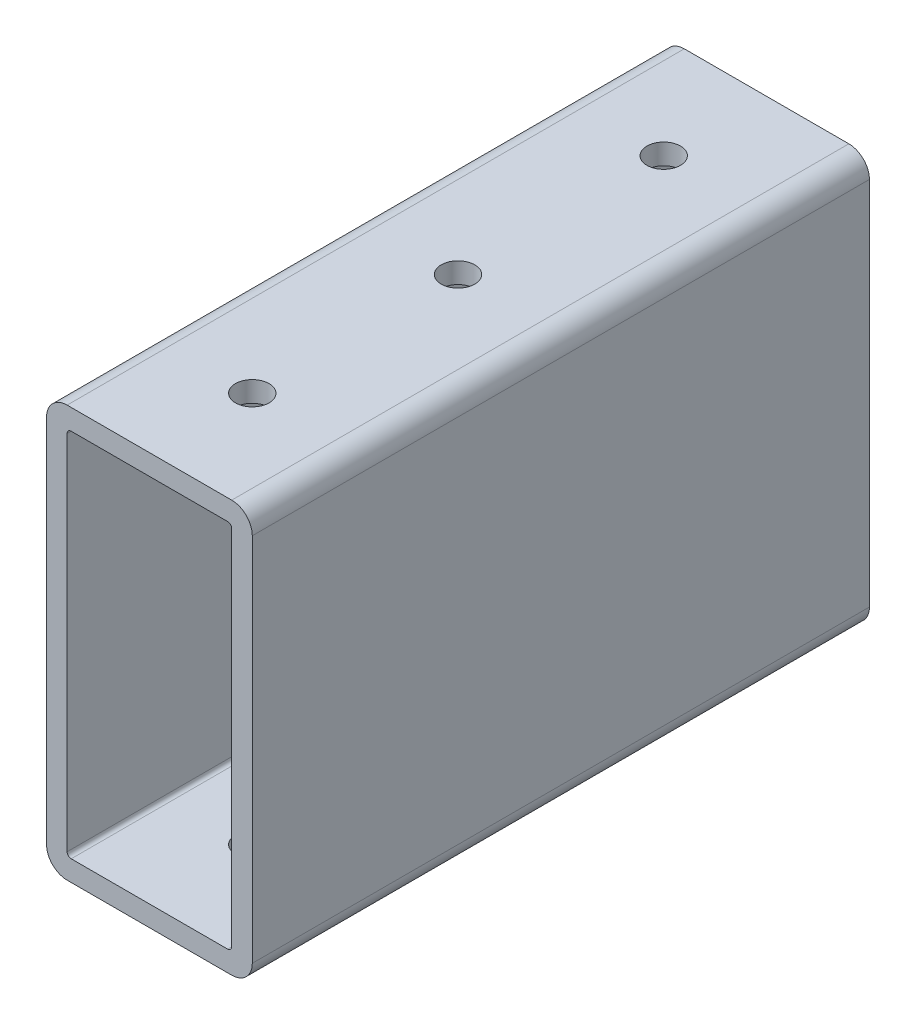
ISO-10303-21;
HEADER;
FILE_DESCRIPTION(('STEP AP214'),'2;1');
FILE_NAME('part.step','',(''),(''),'','','');
FILE_SCHEMA(('AUTOMOTIVE_DESIGN { 1 0 10303 214 1 1 1 1 }'));
ENDSEC;
DATA;
#1=APPLICATION_CONTEXT('core data for automotive mechanical design processes');
#2=APPLICATION_PROTOCOL_DEFINITION('international standard','automotive_design',2000,#1);
#3=PRODUCT_CONTEXT('',#1,'mechanical');
#4=PRODUCT('Part','Part','',(#3));
#5=PRODUCT_RELATED_PRODUCT_CATEGORY('part','',(#4));
#6=PRODUCT_DEFINITION_FORMATION('','',#4);
#7=PRODUCT_DEFINITION_CONTEXT('part definition',#1,'design');
#8=PRODUCT_DEFINITION('design','',#6,#7);
#9=PRODUCT_DEFINITION_SHAPE('','',#8);
#10=(LENGTH_UNIT() NAMED_UNIT(*) SI_UNIT(.MILLI.,.METRE.));
#11=(NAMED_UNIT(*) PLANE_ANGLE_UNIT() SI_UNIT($,.RADIAN.));
#12=(NAMED_UNIT(*) SI_UNIT($,.STERADIAN.) SOLID_ANGLE_UNIT());
#13=UNCERTAINTY_MEASURE_WITH_UNIT(LENGTH_MEASURE(1.E-05),#10,'distance_accuracy_value','');
#14=(GEOMETRIC_REPRESENTATION_CONTEXT(3) GLOBAL_UNCERTAINTY_ASSIGNED_CONTEXT((#13)) GLOBAL_UNIT_ASSIGNED_CONTEXT((#10,
#11,#12)) REPRESENTATION_CONTEXT('',''));
#15=CARTESIAN_POINT('',(0.,0.,0.));
#16=DIRECTION('',(0.,0.,1.));
#17=DIRECTION('',(1.,0.,0.));
#18=AXIS2_PLACEMENT_3D('',#15,#16,#17);
#19=CARTESIAN_POINT('',(-12.7,-25.4,38.1));
#20=DIRECTION('',(0.,-1.,0.));
#21=DIRECTION('',(0.,0.,-1.));
#22=AXIS2_PLACEMENT_3D('',#19,#20,#21);
#23=PLANE('',#22);
#24=CARTESIAN_POINT('',(0.,-25.4,-25.4));
#25=DIRECTION('',(0.,-1.,0.));
#26=DIRECTION('',(0.,0.,-1.));
#27=AXIS2_PLACEMENT_3D('',#24,#25,#26);
#28=CIRCLE('',#27,2.07009999999995);
#29=CARTESIAN_POINT('',(0.,-25.4,-27.4700999999999));
#30=VERTEX_POINT('',#29);
#31=EDGE_CURVE('E390',#30,#30,#28,.T.);
#32=ORIENTED_EDGE('',*,*,#31,.F.);
#33=EDGE_LOOP('',(#32));
#34=FACE_BOUND('',#33,.T.);
#35=CARTESIAN_POINT('',(0.,-25.4,0.));
#36=DIRECTION('',(0.,-1.,0.));
#37=DIRECTION('',(0.,0.,-1.));
#38=AXIS2_PLACEMENT_3D('',#35,#36,#37);
#39=CIRCLE('',#38,2.07009999999995);
#40=CARTESIAN_POINT('',(0.,-25.4,-2.07009999999995));
#41=VERTEX_POINT('',#40);
#42=EDGE_CURVE('E400',#41,#41,#39,.T.);
#43=ORIENTED_EDGE('',*,*,#42,.F.);
#44=EDGE_LOOP('',(#43));
#45=FACE_BOUND('',#44,.T.);
#46=CARTESIAN_POINT('',(0.,-25.4,25.4000000000001));
#47=DIRECTION('',(0.,-1.,0.));
#48=DIRECTION('',(0.,0.,-1.));
#49=AXIS2_PLACEMENT_3D('',#46,#47,#48);
#50=CIRCLE('',#49,2.07009999999995);
#51=CARTESIAN_POINT('',(0.,-25.4,23.3299000000001));
#52=VERTEX_POINT('',#51);
#53=EDGE_CURVE('E406',#52,#52,#50,.T.);
#54=ORIENTED_EDGE('',*,*,#53,.F.);
#55=EDGE_LOOP('',(#54));
#56=FACE_BOUND('',#55,.T.);
#57=DIRECTION('',(1.,0.,0.));
#58=VECTOR('',#57,1.);
#59=CARTESIAN_POINT('',(-12.7,-25.4,38.1));
#60=LINE('',#59,#58);
#61=CARTESIAN_POINT('',(-10.16,-25.4,38.1));
#62=VERTEX_POINT('',#61);
#63=CARTESIAN_POINT('',(10.16,-25.4,38.1));
#64=VERTEX_POINT('',#63);
#65=EDGE_CURVE('E193',#62,#64,#60,.T.);
#66=ORIENTED_EDGE('',*,*,#65,.F.);
#67=DIRECTION('',(0.,0.,-1.));
#68=VECTOR('',#67,1.);
#69=CARTESIAN_POINT('',(-10.16,-25.4,-38.1));
#70=LINE('',#69,#68);
#71=CARTESIAN_POINT('',(-10.16,-25.4,-38.1));
#72=VERTEX_POINT('',#71);
#73=EDGE_CURVE('E257',#62,#72,#70,.T.);
#74=ORIENTED_EDGE('',*,*,#73,.T.);
#75=DIRECTION('',(1.,0.,0.));
#76=VECTOR('',#75,1.);
#77=CARTESIAN_POINT('',(-12.7,-25.4,-38.1));
#78=LINE('',#77,#76);
#79=CARTESIAN_POINT('',(10.16,-25.4,-38.1));
#80=VERTEX_POINT('',#79);
#81=EDGE_CURVE('E187',#72,#80,#78,.T.);
#82=ORIENTED_EDGE('',*,*,#81,.T.);
#83=DIRECTION('',(0.,0.,-1.));
#84=VECTOR('',#83,1.);
#85=CARTESIAN_POINT('',(10.16,-25.4,38.1));
#86=LINE('',#85,#84);
#87=EDGE_CURVE('E255',#80,#64,#86,.F.);
#88=ORIENTED_EDGE('',*,*,#87,.T.);
#89=EDGE_LOOP('',(#66,#74,#82,#88));
#90=FACE_BOUND('',#89,.T.);
#91=ADVANCED_FACE('F32',(#34,#45,#56,#90),#23,.T.);
#92=CARTESIAN_POINT('',(-12.7,25.4,38.1));
#93=DIRECTION('',(0.,0.,1.));
#94=DIRECTION('',(1.,0.,0.));
#95=AXIS2_PLACEMENT_3D('',#92,#93,#94);
#96=PLANE('',#95);
#97=DIRECTION('',(0.,-1.,0.));
#98=VECTOR('',#97,1.);
#99=CARTESIAN_POINT('',(10.1600000000001,22.86,38.1));
#100=LINE('',#99,#98);
#101=CARTESIAN_POINT('',(10.1600000000001,22.36,38.1));
#102=VERTEX_POINT('',#101);
#103=CARTESIAN_POINT('',(10.1600000000001,-22.36,38.1));
#104=VERTEX_POINT('',#103);
#105=EDGE_CURVE('E164',#102,#104,#100,.T.);
#106=ORIENTED_EDGE('',*,*,#105,.T.);
#107=CARTESIAN_POINT('',(9.66000000000006,-22.36,38.1));
#108=DIRECTION('',(0.,0.,1.));
#109=DIRECTION('',(1.,0.,0.));
#110=AXIS2_PLACEMENT_3D('',#107,#108,#109);
#111=CIRCLE('',#110,0.5);
#112=CARTESIAN_POINT('',(9.66000000000006,-22.86,38.1));
#113=VERTEX_POINT('',#112);
#114=EDGE_CURVE('E227',#104,#113,#111,.F.);
#115=ORIENTED_EDGE('',*,*,#114,.T.);
#116=DIRECTION('',(-1.,0.,0.));
#117=VECTOR('',#116,1.);
#118=CARTESIAN_POINT('',(10.1600000000001,-22.86,38.1));
#119=LINE('',#118,#117);
#120=CARTESIAN_POINT('',(-9.66,-22.86,38.1));
#121=VERTEX_POINT('',#120);
#122=EDGE_CURVE('E171',#113,#121,#119,.T.);
#123=ORIENTED_EDGE('',*,*,#122,.T.);
#124=CARTESIAN_POINT('',(-9.66,-22.36,38.1));
#125=DIRECTION('',(0.,0.,1.));
#126=DIRECTION('',(1.,0.,0.));
#127=AXIS2_PLACEMENT_3D('',#124,#125,#126);
#128=CIRCLE('',#127,0.5);
#129=CARTESIAN_POINT('',(-10.16,-22.36,38.1));
#130=VERTEX_POINT('',#129);
#131=EDGE_CURVE('E220',#121,#130,#128,.F.);
#132=ORIENTED_EDGE('',*,*,#131,.T.);
#133=DIRECTION('',(0.,1.,0.));
#134=VECTOR('',#133,1.);
#135=CARTESIAN_POINT('',(-10.16,-22.86,38.1));
#136=LINE('',#135,#134);
#137=CARTESIAN_POINT('',(-10.16,22.3599999999999,38.1));
#138=VERTEX_POINT('',#137);
#139=EDGE_CURVE('E175',#130,#138,#136,.T.);
#140=ORIENTED_EDGE('',*,*,#139,.T.);
#141=CARTESIAN_POINT('',(-9.66,22.36,38.1));
#142=DIRECTION('',(0.,0.,1.));
#143=DIRECTION('',(1.,0.,0.));
#144=AXIS2_PLACEMENT_3D('',#141,#142,#143);
#145=CIRCLE('',#144,0.5);
#146=CARTESIAN_POINT('',(-9.66,22.86,38.1));
#147=VERTEX_POINT('',#146);
#148=EDGE_CURVE('E224',#138,#147,#145,.F.);
#149=ORIENTED_EDGE('',*,*,#148,.T.);
#150=DIRECTION('',(1.,0.,0.));
#151=VECTOR('',#150,1.);
#152=CARTESIAN_POINT('',(-10.16,22.86,38.1));
#153=LINE('',#152,#151);
#154=CARTESIAN_POINT('',(9.66000000000006,22.86,38.1));
#155=VERTEX_POINT('',#154);
#156=EDGE_CURVE('E331',#147,#155,#153,.T.);
#157=ORIENTED_EDGE('',*,*,#156,.T.);
#158=CARTESIAN_POINT('',(9.66000000000006,22.36,38.1));
#159=DIRECTION('',(0.,0.,1.));
#160=DIRECTION('',(1.,0.,0.));
#161=AXIS2_PLACEMENT_3D('',#158,#159,#160);
#162=CIRCLE('',#161,0.5);
#163=EDGE_CURVE('E154',#155,#102,#162,.F.);
#164=ORIENTED_EDGE('',*,*,#163,.T.);
#165=EDGE_LOOP('',(#106,#115,#123,#132,#140,#149,#157,#164));
#166=FACE_BOUND('',#165,.T.);
#167=DIRECTION('',(0.,-1.,0.));
#168=VECTOR('',#167,1.);
#169=CARTESIAN_POINT('',(12.7,25.4,38.1));
#170=LINE('',#169,#168);
#171=CARTESIAN_POINT('',(12.7,22.86,38.1));
#172=VERTEX_POINT('',#171);
#173=CARTESIAN_POINT('',(12.7,-22.86,38.1));
#174=VERTEX_POINT('',#173);
#175=EDGE_CURVE('E184',#172,#174,#170,.T.);
#176=ORIENTED_EDGE('',*,*,#175,.F.);
#177=CARTESIAN_POINT('',(10.16,22.86,38.1));
#178=DIRECTION('',(0.,0.,1.));
#179=DIRECTION('',(1.,0.,0.));
#180=AXIS2_PLACEMENT_3D('',#177,#178,#179);
#181=CIRCLE('',#180,2.54);
#182=CARTESIAN_POINT('',(10.16,25.4,38.1));
#183=VERTEX_POINT('',#182);
#184=EDGE_CURVE('E241',#172,#183,#181,.T.);
#185=ORIENTED_EDGE('',*,*,#184,.T.);
#186=DIRECTION('',(1.,0.,0.));
#187=VECTOR('',#186,1.);
#188=CARTESIAN_POINT('',(-12.7,25.4,38.1));
#189=LINE('',#188,#187);
#190=CARTESIAN_POINT('',(-10.16,25.4,38.1));
#191=VERTEX_POINT('',#190);
#192=EDGE_CURVE('E196',#191,#183,#189,.T.);
#193=ORIENTED_EDGE('',*,*,#192,.F.);
#194=CARTESIAN_POINT('',(-10.16,22.86,38.1));
#195=DIRECTION('',(0.,0.,1.));
#196=DIRECTION('',(1.,0.,0.));
#197=AXIS2_PLACEMENT_3D('',#194,#195,#196);
#198=CIRCLE('',#197,2.54);
#199=CARTESIAN_POINT('',(-12.7,22.86,38.1));
#200=VERTEX_POINT('',#199);
#201=EDGE_CURVE('E235',#191,#200,#198,.T.);
#202=ORIENTED_EDGE('',*,*,#201,.T.);
#203=DIRECTION('',(0.,-1.,0.));
#204=VECTOR('',#203,1.);
#205=CARTESIAN_POINT('',(-12.7,25.4,38.1));
#206=LINE('',#205,#204);
#207=CARTESIAN_POINT('',(-12.7,-22.86,38.1));
#208=VERTEX_POINT('',#207);
#209=EDGE_CURVE('E183',#200,#208,#206,.T.);
#210=ORIENTED_EDGE('',*,*,#209,.T.);
#211=CARTESIAN_POINT('',(-10.16,-22.86,38.1));
#212=DIRECTION('',(0.,0.,1.));
#213=DIRECTION('',(1.,0.,0.));
#214=AXIS2_PLACEMENT_3D('',#211,#212,#213);
#215=CIRCLE('',#214,2.54);
#216=EDGE_CURVE('E239',#208,#62,#215,.T.);
#217=ORIENTED_EDGE('',*,*,#216,.T.);
#218=ORIENTED_EDGE('',*,*,#65,.T.);
#219=CARTESIAN_POINT('',(10.16,-22.86,38.1));
#220=DIRECTION('',(0.,0.,1.));
#221=DIRECTION('',(1.,0.,0.));
#222=AXIS2_PLACEMENT_3D('',#219,#220,#221);
#223=CIRCLE('',#222,2.54);
#224=EDGE_CURVE('E237',#64,#174,#223,.T.);
#225=ORIENTED_EDGE('',*,*,#224,.T.);
#226=EDGE_LOOP('',(#176,#185,#193,#202,#210,#217,#218,#225));
#227=FACE_BOUND('',#226,.T.);
#228=ADVANCED_FACE('F275',(#166,#227),#96,.T.);
#229=CARTESIAN_POINT('',(-12.7,25.4,-38.1));
#230=DIRECTION('',(0.,1.,0.));
#231=DIRECTION('',(0.,0.,1.));
#232=AXIS2_PLACEMENT_3D('',#229,#230,#231);
#233=PLANE('',#232);
#234=CARTESIAN_POINT('',(0.,25.4,-25.4));
#235=DIRECTION('',(0.,1.,0.));
#236=DIRECTION('',(0.,0.,1.));
#237=AXIS2_PLACEMENT_3D('',#234,#235,#236);
#238=CIRCLE('',#237,2.07009999999995);
#239=CARTESIAN_POINT('',(0.,25.4,-23.3299));
#240=VERTEX_POINT('',#239);
#241=EDGE_CURVE('E377',#240,#240,#238,.T.);
#242=ORIENTED_EDGE('',*,*,#241,.F.);
#243=EDGE_LOOP('',(#242));
#244=FACE_BOUND('',#243,.T.);
#245=CARTESIAN_POINT('',(0.,25.4,0.));
#246=DIRECTION('',(0.,1.,0.));
#247=DIRECTION('',(0.,0.,1.));
#248=AXIS2_PLACEMENT_3D('',#245,#246,#247);
#249=CIRCLE('',#248,2.07009999999995);
#250=CARTESIAN_POINT('',(0.,25.4,2.07009999999995));
#251=VERTEX_POINT('',#250);
#252=EDGE_CURVE('E381',#251,#251,#249,.T.);
#253=ORIENTED_EDGE('',*,*,#252,.F.);
#254=EDGE_LOOP('',(#253));
#255=FACE_BOUND('',#254,.T.);
#256=CARTESIAN_POINT('',(0.,25.4,25.4000000000001));
#257=DIRECTION('',(0.,1.,0.));
#258=DIRECTION('',(0.,0.,1.));
#259=AXIS2_PLACEMENT_3D('',#256,#257,#258);
#260=CIRCLE('',#259,2.07009999999995);
#261=CARTESIAN_POINT('',(0.,25.4,27.4701));
#262=VERTEX_POINT('',#261);
#263=EDGE_CURVE('E384',#262,#262,#260,.T.);
#264=ORIENTED_EDGE('',*,*,#263,.F.);
#265=EDGE_LOOP('',(#264));
#266=FACE_BOUND('',#265,.T.);
#267=ORIENTED_EDGE('',*,*,#192,.T.);
#268=DIRECTION('',(0.,0.,1.));
#269=VECTOR('',#268,1.);
#270=CARTESIAN_POINT('',(10.16,25.4,-38.1));
#271=LINE('',#270,#269);
#272=CARTESIAN_POINT('',(10.16,25.4,-38.1));
#273=VERTEX_POINT('',#272);
#274=EDGE_CURVE('E246',#183,#273,#271,.F.);
#275=ORIENTED_EDGE('',*,*,#274,.T.);
#276=DIRECTION('',(1.,0.,0.));
#277=VECTOR('',#276,1.);
#278=CARTESIAN_POINT('',(-12.7,25.4,-38.1));
#279=LINE('',#278,#277);
#280=CARTESIAN_POINT('',(-10.16,25.4,-38.1));
#281=VERTEX_POINT('',#280);
#282=EDGE_CURVE('E199',#281,#273,#279,.T.);
#283=ORIENTED_EDGE('',*,*,#282,.F.);
#284=DIRECTION('',(0.,0.,1.));
#285=VECTOR('',#284,1.);
#286=CARTESIAN_POINT('',(-10.16,25.4,38.1));
#287=LINE('',#286,#285);
#288=EDGE_CURVE('E243',#281,#191,#287,.T.);
#289=ORIENTED_EDGE('',*,*,#288,.T.);
#290=EDGE_LOOP('',(#267,#275,#283,#289));
#291=FACE_BOUND('',#290,.T.);
#292=ADVANCED_FACE('F285',(#244,#255,#266,#291),#233,.T.);
#293=CARTESIAN_POINT('',(-12.7,-25.4,-38.1));
#294=DIRECTION('',(0.,0.,-1.));
#295=DIRECTION('',(-1.,0.,0.));
#296=AXIS2_PLACEMENT_3D('',#293,#294,#295);
#297=PLANE('',#296);
#298=DIRECTION('',(-1.,0.,0.));
#299=VECTOR('',#298,1.);
#300=CARTESIAN_POINT('',(10.1600000000001,-22.86,-38.1));
#301=LINE('',#300,#299);
#302=CARTESIAN_POINT('',(9.66000000000006,-22.86,-38.1));
#303=VERTEX_POINT('',#302);
#304=CARTESIAN_POINT('',(-9.66,-22.86,-38.1));
#305=VERTEX_POINT('',#304);
#306=EDGE_CURVE('E339',#303,#305,#301,.T.);
#307=ORIENTED_EDGE('',*,*,#306,.F.);
#308=CARTESIAN_POINT('',(9.66000000000006,-22.36,-38.1));
#309=DIRECTION('',(0.,0.,-1.));
#310=DIRECTION('',(-1.,0.,0.));
#311=AXIS2_PLACEMENT_3D('',#308,#309,#310);
#312=CIRCLE('',#311,0.5);
#313=CARTESIAN_POINT('',(10.1600000000001,-22.36,-38.1));
#314=VERTEX_POINT('',#313);
#315=EDGE_CURVE('E170',#303,#314,#312,.F.);
#316=ORIENTED_EDGE('',*,*,#315,.T.);
#317=DIRECTION('',(0.,-1.,0.));
#318=VECTOR('',#317,1.);
#319=CARTESIAN_POINT('',(10.1600000000001,22.86,-38.1));
#320=LINE('',#319,#318);
#321=CARTESIAN_POINT('',(10.1600000000001,22.36,-38.1));
#322=VERTEX_POINT('',#321);
#323=EDGE_CURVE('E161',#322,#314,#320,.T.);
#324=ORIENTED_EDGE('',*,*,#323,.F.);
#325=CARTESIAN_POINT('',(9.66000000000006,22.36,-38.1));
#326=DIRECTION('',(0.,0.,-1.));
#327=DIRECTION('',(-1.,0.,0.));
#328=AXIS2_PLACEMENT_3D('',#325,#326,#327);
#329=CIRCLE('',#328,0.5);
#330=CARTESIAN_POINT('',(9.66000000000006,22.86,-38.1));
#331=VERTEX_POINT('',#330);
#332=EDGE_CURVE('E144',#322,#331,#329,.F.);
#333=ORIENTED_EDGE('',*,*,#332,.T.);
#334=DIRECTION('',(1.,0.,0.));
#335=VECTOR('',#334,1.);
#336=CARTESIAN_POINT('',(-10.16,22.86,-38.1));
#337=LINE('',#336,#335);
#338=CARTESIAN_POINT('',(-9.66,22.86,-38.1));
#339=VERTEX_POINT('',#338);
#340=EDGE_CURVE('E172',#339,#331,#337,.T.);
#341=ORIENTED_EDGE('',*,*,#340,.F.);
#342=CARTESIAN_POINT('',(-9.66,22.36,-38.1));
#343=DIRECTION('',(0.,0.,-1.));
#344=DIRECTION('',(-1.,0.,0.));
#345=AXIS2_PLACEMENT_3D('',#342,#343,#344);
#346=CIRCLE('',#345,0.5);
#347=CARTESIAN_POINT('',(-10.16,22.3599999999999,-38.1));
#348=VERTEX_POINT('',#347);
#349=EDGE_CURVE('E222',#339,#348,#346,.F.);
#350=ORIENTED_EDGE('',*,*,#349,.T.);
#351=DIRECTION('',(0.,1.,0.));
#352=VECTOR('',#351,1.);
#353=CARTESIAN_POINT('',(-10.16,-22.86,-38.1));
#354=LINE('',#353,#352);
#355=CARTESIAN_POINT('',(-10.16,-22.36,-38.1));
#356=VERTEX_POINT('',#355);
#357=EDGE_CURVE('E177',#356,#348,#354,.T.);
#358=ORIENTED_EDGE('',*,*,#357,.F.);
#359=CARTESIAN_POINT('',(-9.66,-22.36,-38.1));
#360=DIRECTION('',(0.,0.,-1.));
#361=DIRECTION('',(-1.,0.,0.));
#362=AXIS2_PLACEMENT_3D('',#359,#360,#361);
#363=CIRCLE('',#362,0.5);
#364=EDGE_CURVE('E218',#356,#305,#363,.F.);
#365=ORIENTED_EDGE('',*,*,#364,.T.);
#366=EDGE_LOOP('',(#307,#316,#324,#333,#341,#350,#358,#365));
#367=FACE_BOUND('',#366,.T.);
#368=ORIENTED_EDGE('',*,*,#282,.T.);
#369=CARTESIAN_POINT('',(10.16,22.86,-38.1));
#370=DIRECTION('',(0.,0.,-1.));
#371=DIRECTION('',(-1.,0.,0.));
#372=AXIS2_PLACEMENT_3D('',#369,#370,#371);
#373=CIRCLE('',#372,2.54);
#374=CARTESIAN_POINT('',(12.7,22.86,-38.1));
#375=VERTEX_POINT('',#374);
#376=EDGE_CURVE('E253',#273,#375,#373,.T.);
#377=ORIENTED_EDGE('',*,*,#376,.T.);
#378=DIRECTION('',(0.,1.,0.));
#379=VECTOR('',#378,1.);
#380=CARTESIAN_POINT('',(12.7,-25.4,-38.1));
#381=LINE('',#380,#379);
#382=CARTESIAN_POINT('',(12.7,-22.86,-38.1));
#383=VERTEX_POINT('',#382);
#384=EDGE_CURVE('E188',#383,#375,#381,.T.);
#385=ORIENTED_EDGE('',*,*,#384,.F.);
#386=CARTESIAN_POINT('',(10.16,-22.86,-38.1));
#387=DIRECTION('',(0.,0.,-1.));
#388=DIRECTION('',(-1.,0.,0.));
#389=AXIS2_PLACEMENT_3D('',#386,#387,#388);
#390=CIRCLE('',#389,2.54);
#391=EDGE_CURVE('E250',#383,#80,#390,.T.);
#392=ORIENTED_EDGE('',*,*,#391,.T.);
#393=ORIENTED_EDGE('',*,*,#81,.F.);
#394=CARTESIAN_POINT('',(-10.16,-22.86,-38.1));
#395=DIRECTION('',(0.,0.,-1.));
#396=DIRECTION('',(-1.,0.,0.));
#397=AXIS2_PLACEMENT_3D('',#394,#395,#396);
#398=CIRCLE('',#397,2.54);
#399=CARTESIAN_POINT('',(-12.7,-22.86,-38.1));
#400=VERTEX_POINT('',#399);
#401=EDGE_CURVE('E53',#72,#400,#398,.T.);
#402=ORIENTED_EDGE('',*,*,#401,.T.);
#403=DIRECTION('',(0.,1.,0.));
#404=VECTOR('',#403,1.);
#405=CARTESIAN_POINT('',(-12.7,-25.4,-38.1));
#406=LINE('',#405,#404);
#407=CARTESIAN_POINT('',(-12.7,22.86,-38.1));
#408=VERTEX_POINT('',#407);
#409=EDGE_CURVE('E181',#400,#408,#406,.T.);
#410=ORIENTED_EDGE('',*,*,#409,.T.);
#411=CARTESIAN_POINT('',(-10.16,22.86,-38.1));
#412=DIRECTION('',(0.,0.,-1.));
#413=DIRECTION('',(-1.,0.,0.));
#414=AXIS2_PLACEMENT_3D('',#411,#412,#413);
#415=CIRCLE('',#414,2.54);
#416=EDGE_CURVE('E248',#408,#281,#415,.T.);
#417=ORIENTED_EDGE('',*,*,#416,.T.);
#418=EDGE_LOOP('',(#368,#377,#385,#392,#393,#402,#410,#417));
#419=FACE_BOUND('',#418,.T.);
#420=ADVANCED_FACE('F169',(#367,#419),#297,.T.);
#421=CARTESIAN_POINT('',(-12.7,0.,0.));
#422=DIRECTION('',(1.,0.,0.));
#423=DIRECTION('',(0.,0.,-1.));
#424=AXIS2_PLACEMENT_3D('',#421,#422,#423);
#425=PLANE('',#424);
#426=ORIENTED_EDGE('',*,*,#409,.F.);
#427=DIRECTION('',(0.,0.,-1.));
#428=VECTOR('',#427,1.);
#429=CARTESIAN_POINT('',(-12.7,-22.86,38.1));
#430=LINE('',#429,#428);
#431=EDGE_CURVE('E11',#400,#208,#430,.F.);
#432=ORIENTED_EDGE('',*,*,#431,.T.);
#433=ORIENTED_EDGE('',*,*,#209,.F.);
#434=DIRECTION('',(0.,0.,1.));
#435=VECTOR('',#434,1.);
#436=CARTESIAN_POINT('',(-12.7,22.86,-38.1));
#437=LINE('',#436,#435);
#438=EDGE_CURVE('E40',#200,#408,#437,.F.);
#439=ORIENTED_EDGE('',*,*,#438,.T.);
#440=EDGE_LOOP('',(#426,#432,#433,#439));
#441=FACE_BOUND('',#440,.T.);
#442=ADVANCED_FACE('F279',(#441),#425,.F.);
#443=CARTESIAN_POINT('',(12.7,0.,0.));
#444=DIRECTION('',(1.,0.,0.));
#445=DIRECTION('',(0.,0.,-1.));
#446=AXIS2_PLACEMENT_3D('',#443,#444,#445);
#447=PLANE('',#446);
#448=ORIENTED_EDGE('',*,*,#384,.T.);
#449=DIRECTION('',(0.,0.,1.));
#450=VECTOR('',#449,1.);
#451=CARTESIAN_POINT('',(12.7,22.86,0.));
#452=LINE('',#451,#450);
#453=EDGE_CURVE('E232',#375,#172,#452,.T.);
#454=ORIENTED_EDGE('',*,*,#453,.T.);
#455=ORIENTED_EDGE('',*,*,#175,.T.);
#456=DIRECTION('',(0.,0.,-1.));
#457=VECTOR('',#456,1.);
#458=CARTESIAN_POINT('',(12.7,-22.86,0.));
#459=LINE('',#458,#457);
#460=EDGE_CURVE('E229',#174,#383,#459,.T.);
#461=ORIENTED_EDGE('',*,*,#460,.T.);
#462=EDGE_LOOP('',(#448,#454,#455,#461));
#463=FACE_BOUND('',#462,.T.);
#464=ADVANCED_FACE('F271',(#463),#447,.T.);
#465=CARTESIAN_POINT('',(10.1600000000001,-22.86,38.1));
#466=DIRECTION('',(0.,-1.,0.));
#467=DIRECTION('',(0.,0.,-1.));
#468=AXIS2_PLACEMENT_3D('',#465,#466,#467);
#469=PLANE('',#468);
#470=CARTESIAN_POINT('',(0.,-22.86,-25.4));
#471=DIRECTION('',(0.,-1.,0.));
#472=DIRECTION('',(0.,0.,-1.));
#473=AXIS2_PLACEMENT_3D('',#470,#471,#472);
#474=CIRCLE('',#473,2.07009999999995);
#475=CARTESIAN_POINT('',(0.,-22.86,-27.4700999999999));
#476=VERTEX_POINT('',#475);
#477=EDGE_CURVE('E398',#476,#476,#474,.T.);
#478=ORIENTED_EDGE('',*,*,#477,.T.);
#479=EDGE_LOOP('',(#478));
#480=FACE_BOUND('',#479,.T.);
#481=CARTESIAN_POINT('',(0.,-22.86,0.));
#482=DIRECTION('',(0.,-1.,0.));
#483=DIRECTION('',(0.,0.,-1.));
#484=AXIS2_PLACEMENT_3D('',#481,#482,#483);
#485=CIRCLE('',#484,2.07009999999995);
#486=CARTESIAN_POINT('',(0.,-22.86,-2.07009999999995));
#487=VERTEX_POINT('',#486);
#488=EDGE_CURVE('E403',#487,#487,#485,.T.);
#489=ORIENTED_EDGE('',*,*,#488,.T.);
#490=EDGE_LOOP('',(#489));
#491=FACE_BOUND('',#490,.T.);
#492=CARTESIAN_POINT('',(0.,-22.86,25.4000000000001));
#493=DIRECTION('',(0.,-1.,0.));
#494=DIRECTION('',(0.,0.,-1.));
#495=AXIS2_PLACEMENT_3D('',#492,#493,#494);
#496=CIRCLE('',#495,2.07009999999995);
#497=CARTESIAN_POINT('',(0.,-22.86,23.3299000000001));
#498=VERTEX_POINT('',#497);
#499=EDGE_CURVE('E341',#498,#498,#496,.T.);
#500=ORIENTED_EDGE('',*,*,#499,.T.);
#501=EDGE_LOOP('',(#500));
#502=FACE_BOUND('',#501,.T.);
#503=ORIENTED_EDGE('',*,*,#306,.T.);
#504=DIRECTION('',(0.,0.,-1.));
#505=VECTOR('',#504,1.);
#506=CARTESIAN_POINT('',(-9.66,-22.86,38.1));
#507=LINE('',#506,#505);
#508=EDGE_CURVE('E155',#305,#121,#507,.F.);
#509=ORIENTED_EDGE('',*,*,#508,.T.);
#510=ORIENTED_EDGE('',*,*,#122,.F.);
#511=DIRECTION('',(0.,0.,-1.));
#512=VECTOR('',#511,1.);
#513=CARTESIAN_POINT('',(9.66000000000006,-22.86,-38.1));
#514=LINE('',#513,#512);
#515=EDGE_CURVE('E213',#113,#303,#514,.T.);
#516=ORIENTED_EDGE('',*,*,#515,.T.);
#517=EDGE_LOOP('',(#503,#509,#510,#516));
#518=FACE_BOUND('',#517,.T.);
#519=ADVANCED_FACE('F349',(#480,#491,#502,#518),#469,.F.);
#520=CARTESIAN_POINT('',(10.1600000000001,22.86,38.1));
#521=DIRECTION('',(1.,0.,0.));
#522=DIRECTION('',(0.,0.,-1.));
#523=AXIS2_PLACEMENT_3D('',#520,#521,#522);
#524=PLANE('',#523);
#525=ORIENTED_EDGE('',*,*,#105,.F.);
#526=DIRECTION('',(0.,0.,-1.));
#527=VECTOR('',#526,1.);
#528=CARTESIAN_POINT('',(10.1600000000001,22.36,-38.1));
#529=LINE('',#528,#527);
#530=EDGE_CURVE('E148',#102,#322,#529,.T.);
#531=ORIENTED_EDGE('',*,*,#530,.T.);
#532=ORIENTED_EDGE('',*,*,#323,.T.);
#533=DIRECTION('',(0.,0.,-1.));
#534=VECTOR('',#533,1.);
#535=CARTESIAN_POINT('',(10.1600000000001,-22.36,38.1));
#536=LINE('',#535,#534);
#537=EDGE_CURVE('E166',#314,#104,#536,.F.);
#538=ORIENTED_EDGE('',*,*,#537,.T.);
#539=EDGE_LOOP('',(#525,#531,#532,#538));
#540=FACE_BOUND('',#539,.T.);
#541=ADVANCED_FACE('F160',(#540),#524,.F.);
#542=CARTESIAN_POINT('',(-10.16,22.86,38.1));
#543=DIRECTION('',(0.,1.,0.));
#544=DIRECTION('',(0.,0.,1.));
#545=AXIS2_PLACEMENT_3D('',#542,#543,#544);
#546=PLANE('',#545);
#547=CARTESIAN_POINT('',(0.,22.86,-25.4));
#548=DIRECTION('',(0.,1.,0.));
#549=DIRECTION('',(0.,0.,1.));
#550=AXIS2_PLACEMENT_3D('',#547,#548,#549);
#551=CIRCLE('',#550,2.07009999999995);
#552=CARTESIAN_POINT('',(0.,22.86,-23.3299));
#553=VERTEX_POINT('',#552);
#554=EDGE_CURVE('E435',#553,#553,#551,.T.);
#555=ORIENTED_EDGE('',*,*,#554,.T.);
#556=EDGE_LOOP('',(#555));
#557=FACE_BOUND('',#556,.T.);
#558=CARTESIAN_POINT('',(0.,22.86,0.));
#559=DIRECTION('',(0.,1.,0.));
#560=DIRECTION('',(0.,0.,1.));
#561=AXIS2_PLACEMENT_3D('',#558,#559,#560);
#562=CIRCLE('',#561,2.07009999999995);
#563=CARTESIAN_POINT('',(0.,22.86,2.07009999999995));
#564=VERTEX_POINT('',#563);
#565=EDGE_CURVE('E387',#564,#564,#562,.T.);
#566=ORIENTED_EDGE('',*,*,#565,.T.);
#567=EDGE_LOOP('',(#566));
#568=FACE_BOUND('',#567,.T.);
#569=CARTESIAN_POINT('',(0.,22.86,25.4000000000001));
#570=DIRECTION('',(0.,1.,0.));
#571=DIRECTION('',(0.,0.,1.));
#572=AXIS2_PLACEMENT_3D('',#569,#570,#571);
#573=CIRCLE('',#572,2.07009999999995);
#574=CARTESIAN_POINT('',(0.,22.86,27.4701));
#575=VERTEX_POINT('',#574);
#576=EDGE_CURVE('E386',#575,#575,#573,.T.);
#577=ORIENTED_EDGE('',*,*,#576,.T.);
#578=EDGE_LOOP('',(#577));
#579=FACE_BOUND('',#578,.T.);
#580=ORIENTED_EDGE('',*,*,#340,.T.);
#581=DIRECTION('',(0.,0.,-1.));
#582=VECTOR('',#581,1.);
#583=CARTESIAN_POINT('',(9.66000000000006,22.86,38.1));
#584=LINE('',#583,#582);
#585=EDGE_CURVE('E149',#331,#155,#584,.F.);
#586=ORIENTED_EDGE('',*,*,#585,.T.);
#587=ORIENTED_EDGE('',*,*,#156,.F.);
#588=DIRECTION('',(0.,0.,-1.));
#589=VECTOR('',#588,1.);
#590=CARTESIAN_POINT('',(-9.66,22.86,-38.1));
#591=LINE('',#590,#589);
#592=EDGE_CURVE('E165',#147,#339,#591,.T.);
#593=ORIENTED_EDGE('',*,*,#592,.T.);
#594=EDGE_LOOP('',(#580,#586,#587,#593));
#595=FACE_BOUND('',#594,.T.);
#596=ADVANCED_FACE('F334',(#557,#568,#579,#595),#546,.F.);
#597=CARTESIAN_POINT('',(-10.16,-22.86,38.1));
#598=DIRECTION('',(-1.,0.,0.));
#599=DIRECTION('',(0.,0.,1.));
#600=AXIS2_PLACEMENT_3D('',#597,#598,#599);
#601=PLANE('',#600);
#602=ORIENTED_EDGE('',*,*,#139,.F.);
#603=DIRECTION('',(0.,0.,-1.));
#604=VECTOR('',#603,1.);
#605=CARTESIAN_POINT('',(-10.16,-22.36,-38.1));
#606=LINE('',#605,#604);
#607=EDGE_CURVE('E210',#130,#356,#606,.T.);
#608=ORIENTED_EDGE('',*,*,#607,.T.);
#609=ORIENTED_EDGE('',*,*,#357,.T.);
#610=DIRECTION('',(0.,0.,-1.));
#611=VECTOR('',#610,1.);
#612=CARTESIAN_POINT('',(-10.16,22.36,38.1));
#613=LINE('',#612,#611);
#614=EDGE_CURVE('E208',#348,#138,#613,.F.);
#615=ORIENTED_EDGE('',*,*,#614,.T.);
#616=EDGE_LOOP('',(#602,#608,#609,#615));
#617=FACE_BOUND('',#616,.T.);
#618=ADVANCED_FACE('F345',(#617),#601,.F.);
#619=CARTESIAN_POINT('',(0.,-25.4,25.4000000000001));
#620=DIRECTION('',(0.,-1.,0.));
#621=DIRECTION('',(0.,0.,-1.));
#622=AXIS2_PLACEMENT_3D('',#619,#620,#621);
#623=CYLINDRICAL_SURFACE('',#622,2.07009999999995);
#624=ORIENTED_EDGE('',*,*,#499,.F.);
#625=EDGE_LOOP('',(#624));
#626=FACE_BOUND('',#625,.T.);
#627=ORIENTED_EDGE('',*,*,#53,.T.);
#628=EDGE_LOOP('',(#627));
#629=FACE_BOUND('',#628,.T.);
#630=ADVANCED_FACE('F413',(#626,#629),#623,.F.);
#631=CARTESIAN_POINT('',(0.,-25.4,0.));
#632=DIRECTION('',(0.,-1.,0.));
#633=DIRECTION('',(0.,0.,-1.));
#634=AXIS2_PLACEMENT_3D('',#631,#632,#633);
#635=CYLINDRICAL_SURFACE('',#634,2.07009999999995);
#636=ORIENTED_EDGE('',*,*,#488,.F.);
#637=EDGE_LOOP('',(#636));
#638=FACE_BOUND('',#637,.T.);
#639=ORIENTED_EDGE('',*,*,#42,.T.);
#640=EDGE_LOOP('',(#639));
#641=FACE_BOUND('',#640,.T.);
#642=ADVANCED_FACE('F416',(#638,#641),#635,.F.);
#643=CARTESIAN_POINT('',(0.,-25.4,-25.4));
#644=DIRECTION('',(0.,-1.,0.));
#645=DIRECTION('',(0.,0.,-1.));
#646=AXIS2_PLACEMENT_3D('',#643,#644,#645);
#647=CYLINDRICAL_SURFACE('',#646,2.07009999999995);
#648=ORIENTED_EDGE('',*,*,#477,.F.);
#649=EDGE_LOOP('',(#648));
#650=FACE_BOUND('',#649,.T.);
#651=ORIENTED_EDGE('',*,*,#31,.T.);
#652=EDGE_LOOP('',(#651));
#653=FACE_BOUND('',#652,.T.);
#654=ADVANCED_FACE('F424',(#650,#653),#647,.F.);
#655=CARTESIAN_POINT('',(0.,25.4,25.4000000000001));
#656=DIRECTION('',(0.,1.,0.));
#657=DIRECTION('',(0.,0.,1.));
#658=AXIS2_PLACEMENT_3D('',#655,#656,#657);
#659=CYLINDRICAL_SURFACE('',#658,2.07009999999995);
#660=ORIENTED_EDGE('',*,*,#263,.T.);
#661=EDGE_LOOP('',(#660));
#662=FACE_BOUND('',#661,.T.);
#663=ORIENTED_EDGE('',*,*,#576,.F.);
#664=EDGE_LOOP('',(#663));
#665=FACE_BOUND('',#664,.T.);
#666=ADVANCED_FACE('F440',(#662,#665),#659,.F.);
#667=CARTESIAN_POINT('',(0.,25.4,0.));
#668=DIRECTION('',(0.,1.,0.));
#669=DIRECTION('',(0.,0.,1.));
#670=AXIS2_PLACEMENT_3D('',#667,#668,#669);
#671=CYLINDRICAL_SURFACE('',#670,2.07009999999995);
#672=ORIENTED_EDGE('',*,*,#252,.T.);
#673=EDGE_LOOP('',(#672));
#674=FACE_BOUND('',#673,.T.);
#675=ORIENTED_EDGE('',*,*,#565,.F.);
#676=EDGE_LOOP('',(#675));
#677=FACE_BOUND('',#676,.T.);
#678=ADVANCED_FACE('F442',(#674,#677),#671,.F.);
#679=CARTESIAN_POINT('',(0.,25.4,-25.4));
#680=DIRECTION('',(0.,1.,0.));
#681=DIRECTION('',(0.,0.,1.));
#682=AXIS2_PLACEMENT_3D('',#679,#680,#681);
#683=CYLINDRICAL_SURFACE('',#682,2.07009999999995);
#684=ORIENTED_EDGE('',*,*,#241,.T.);
#685=EDGE_LOOP('',(#684));
#686=FACE_BOUND('',#685,.T.);
#687=ORIENTED_EDGE('',*,*,#554,.F.);
#688=EDGE_LOOP('',(#687));
#689=FACE_BOUND('',#688,.T.);
#690=ADVANCED_FACE('F317',(#686,#689),#683,.F.);
#691=CARTESIAN_POINT('',(9.66000000000006,22.36,38.1));
#692=DIRECTION('',(0.,0.,1.));
#693=DIRECTION('',(1.,0.,0.));
#694=AXIS2_PLACEMENT_3D('',#691,#692,#693);
#695=CYLINDRICAL_SURFACE('',#694,0.5);
#696=ORIENTED_EDGE('',*,*,#163,.F.);
#697=ORIENTED_EDGE('',*,*,#585,.F.);
#698=ORIENTED_EDGE('',*,*,#332,.F.);
#699=ORIENTED_EDGE('',*,*,#530,.F.);
#700=EDGE_LOOP('',(#696,#697,#698,#699));
#701=FACE_BOUND('',#700,.T.);
#702=ADVANCED_FACE('F147',(#701),#695,.F.);
#703=CARTESIAN_POINT('',(-9.66,-22.36,38.1));
#704=DIRECTION('',(0.,0.,1.));
#705=DIRECTION('',(1.,0.,0.));
#706=AXIS2_PLACEMENT_3D('',#703,#704,#705);
#707=CYLINDRICAL_SURFACE('',#706,0.5);
#708=ORIENTED_EDGE('',*,*,#131,.F.);
#709=ORIENTED_EDGE('',*,*,#508,.F.);
#710=ORIENTED_EDGE('',*,*,#364,.F.);
#711=ORIENTED_EDGE('',*,*,#607,.F.);
#712=EDGE_LOOP('',(#708,#709,#710,#711));
#713=FACE_BOUND('',#712,.T.);
#714=ADVANCED_FACE('F316',(#713),#707,.F.);
#715=CARTESIAN_POINT('',(-9.66,22.36,38.1));
#716=DIRECTION('',(0.,0.,1.));
#717=DIRECTION('',(1.,0.,0.));
#718=AXIS2_PLACEMENT_3D('',#715,#716,#717);
#719=CYLINDRICAL_SURFACE('',#718,0.5);
#720=ORIENTED_EDGE('',*,*,#148,.F.);
#721=ORIENTED_EDGE('',*,*,#614,.F.);
#722=ORIENTED_EDGE('',*,*,#349,.F.);
#723=ORIENTED_EDGE('',*,*,#592,.F.);
#724=EDGE_LOOP('',(#720,#721,#722,#723));
#725=FACE_BOUND('',#724,.T.);
#726=ADVANCED_FACE('F298',(#725),#719,.F.);
#727=CARTESIAN_POINT('',(9.66000000000006,-22.36,38.1));
#728=DIRECTION('',(0.,0.,1.));
#729=DIRECTION('',(1.,0.,0.));
#730=AXIS2_PLACEMENT_3D('',#727,#728,#729);
#731=CYLINDRICAL_SURFACE('',#730,0.5);
#732=ORIENTED_EDGE('',*,*,#114,.F.);
#733=ORIENTED_EDGE('',*,*,#537,.F.);
#734=ORIENTED_EDGE('',*,*,#315,.F.);
#735=ORIENTED_EDGE('',*,*,#515,.F.);
#736=EDGE_LOOP('',(#732,#733,#734,#735));
#737=FACE_BOUND('',#736,.T.);
#738=ADVANCED_FACE('F291',(#737),#731,.F.);
#739=CARTESIAN_POINT('',(10.16,22.86,0.));
#740=DIRECTION('',(0.,0.,1.));
#741=DIRECTION('',(1.,0.,0.));
#742=AXIS2_PLACEMENT_3D('',#739,#740,#741);
#743=CYLINDRICAL_SURFACE('',#742,2.54);
#744=ORIENTED_EDGE('',*,*,#376,.F.);
#745=ORIENTED_EDGE('',*,*,#274,.F.);
#746=ORIENTED_EDGE('',*,*,#184,.F.);
#747=ORIENTED_EDGE('',*,*,#453,.F.);
#748=EDGE_LOOP('',(#744,#745,#746,#747));
#749=FACE_BOUND('',#748,.T.);
#750=ADVANCED_FACE('F289',(#749),#743,.T.);
#751=CARTESIAN_POINT('',(-10.16,-22.86,38.1));
#752=DIRECTION('',(0.,0.,1.));
#753=DIRECTION('',(1.,0.,0.));
#754=AXIS2_PLACEMENT_3D('',#751,#752,#753);
#755=CYLINDRICAL_SURFACE('',#754,2.54);
#756=ORIENTED_EDGE('',*,*,#216,.F.);
#757=ORIENTED_EDGE('',*,*,#431,.F.);
#758=ORIENTED_EDGE('',*,*,#401,.F.);
#759=ORIENTED_EDGE('',*,*,#73,.F.);
#760=EDGE_LOOP('',(#756,#757,#758,#759));
#761=FACE_BOUND('',#760,.T.);
#762=ADVANCED_FACE('F278',(#761),#755,.T.);
#763=CARTESIAN_POINT('',(10.16,-22.86,0.));
#764=DIRECTION('',(0.,0.,-1.));
#765=DIRECTION('',(-1.,0.,0.));
#766=AXIS2_PLACEMENT_3D('',#763,#764,#765);
#767=CYLINDRICAL_SURFACE('',#766,2.54);
#768=ORIENTED_EDGE('',*,*,#224,.F.);
#769=ORIENTED_EDGE('',*,*,#87,.F.);
#770=ORIENTED_EDGE('',*,*,#391,.F.);
#771=ORIENTED_EDGE('',*,*,#460,.F.);
#772=EDGE_LOOP('',(#768,#769,#770,#771));
#773=FACE_BOUND('',#772,.T.);
#774=ADVANCED_FACE('F269',(#773),#767,.T.);
#775=CARTESIAN_POINT('',(-10.16,22.86,-38.1));
#776=DIRECTION('',(0.,0.,-1.));
#777=DIRECTION('',(-1.,0.,0.));
#778=AXIS2_PLACEMENT_3D('',#775,#776,#777);
#779=CYLINDRICAL_SURFACE('',#778,2.54);
#780=ORIENTED_EDGE('',*,*,#416,.F.);
#781=ORIENTED_EDGE('',*,*,#438,.F.);
#782=ORIENTED_EDGE('',*,*,#201,.F.);
#783=ORIENTED_EDGE('',*,*,#288,.F.);
#784=EDGE_LOOP('',(#780,#781,#782,#783));
#785=FACE_BOUND('',#784,.T.);
#786=ADVANCED_FACE('F34',(#785),#779,.T.);
#787=CLOSED_SHELL('',(#91,#228,#292,#420,#442,#464,#519,#541,#596,#618,#630,#642,#654,#666,#678,
#690,#702,#714,#726,#738,#750,#762,#774,#786));
#788=MANIFOLD_SOLID_BREP('B2',#787);
#789=ADVANCED_BREP_SHAPE_REPRESENTATION('',(#18,#788),#14);
#790=SHAPE_DEFINITION_REPRESENTATION(#9,#789);
ENDSEC;
END-ISO-10303-21;
